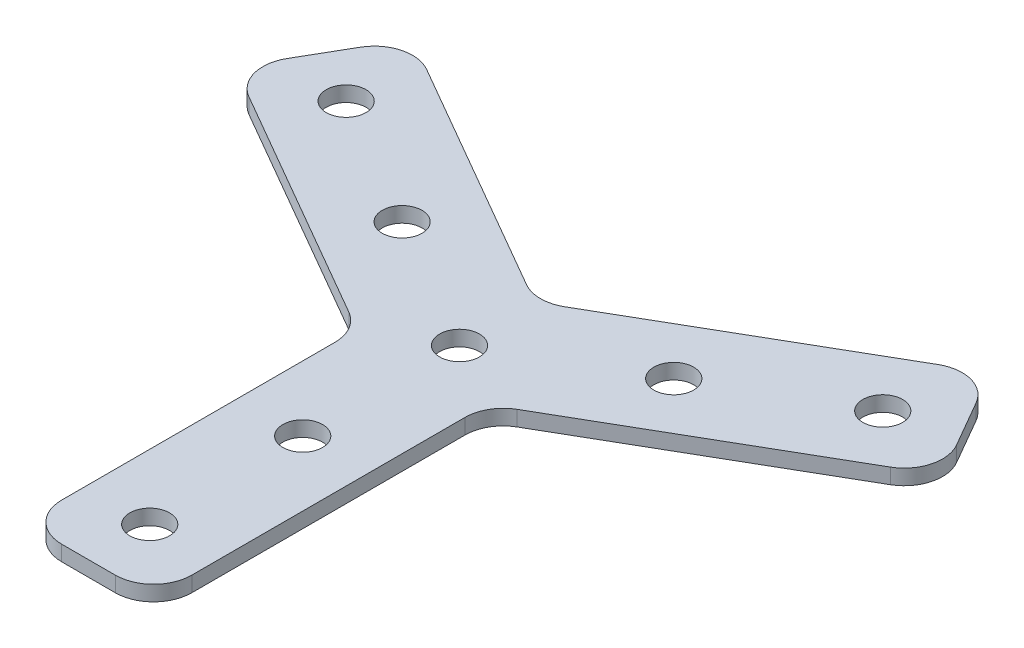
ISO-10303-21;
HEADER;
FILE_DESCRIPTION(('STEP AP214'),'2;1');
FILE_NAME('part.step','',(''),(''),'','','');
FILE_SCHEMA(('AUTOMOTIVE_DESIGN { 1 0 10303 214 1 1 1 1 }'));
ENDSEC;
DATA;
#1=APPLICATION_CONTEXT('core data for automotive mechanical design processes');
#2=APPLICATION_PROTOCOL_DEFINITION('international standard','automotive_design',2000,#1);
#3=PRODUCT_CONTEXT('',#1,'mechanical');
#4=PRODUCT('Part','Part','',(#3));
#5=PRODUCT_RELATED_PRODUCT_CATEGORY('part','',(#4));
#6=PRODUCT_DEFINITION_FORMATION('','',#4);
#7=PRODUCT_DEFINITION_CONTEXT('part definition',#1,'design');
#8=PRODUCT_DEFINITION('design','',#6,#7);
#9=PRODUCT_DEFINITION_SHAPE('','',#8);
#10=(LENGTH_UNIT() NAMED_UNIT(*) SI_UNIT(.MILLI.,.METRE.));
#11=(NAMED_UNIT(*) PLANE_ANGLE_UNIT() SI_UNIT($,.RADIAN.));
#12=(NAMED_UNIT(*) SI_UNIT($,.STERADIAN.) SOLID_ANGLE_UNIT());
#13=UNCERTAINTY_MEASURE_WITH_UNIT(LENGTH_MEASURE(1.E-05),#10,'distance_accuracy_value','');
#14=(GEOMETRIC_REPRESENTATION_CONTEXT(3) GLOBAL_UNCERTAINTY_ASSIGNED_CONTEXT((#13)) GLOBAL_UNIT_ASSIGNED_CONTEXT((#10,
#11,#12)) REPRESENTATION_CONTEXT('',''));
#15=CARTESIAN_POINT('',(0.,0.,0.));
#16=DIRECTION('',(0.,0.,1.));
#17=DIRECTION('',(1.,0.,0.));
#18=AXIS2_PLACEMENT_3D('',#15,#16,#17);
#19=CARTESIAN_POINT('',(-0.941002354523629,3.05807034319605,-10.4761890653163));
#20=DIRECTION('',(0.,-1.,0.));
#21=DIRECTION('',(0.,0.,-1.));
#22=AXIS2_PLACEMENT_3D('',#19,#20,#21);
#23=PLANE('',#22);
#24=CARTESIAN_POINT('',(16.8125184230581,3.05807034319605,-20.726189065315));
#25=DIRECTION('',(0.,1.,0.));
#26=DIRECTION('',(0.,0.,1.));
#27=AXIS2_PLACEMENT_3D('',#24,#25,#26);
#28=CIRCLE('',#27,2.6);
#29=CARTESIAN_POINT('',(16.8125184230581,3.05807034319605,-18.126189065315));
#30=VERTEX_POINT('',#29);
#31=EDGE_CURVE('E173',#30,#30,#28,.T.);
#32=ORIENTED_EDGE('',*,*,#31,.F.);
#33=EDGE_LOOP('',(#32));
#34=FACE_BOUND('',#33,.T.);
#35=CARTESIAN_POINT('',(34.1330264987469,3.05807034319605,-30.726189065315));
#36=DIRECTION('',(0.,1.,0.));
#37=DIRECTION('',(0.,0.,1.));
#38=AXIS2_PLACEMENT_3D('',#35,#36,#37);
#39=CIRCLE('',#38,2.6);
#40=CARTESIAN_POINT('',(34.1330264987469,3.05807034319605,-28.126189065315));
#41=VERTEX_POINT('',#40);
#42=EDGE_CURVE('E323',#41,#41,#39,.T.);
#43=ORIENTED_EDGE('',*,*,#42,.F.);
#44=EDGE_LOOP('',(#43));
#45=FACE_BOUND('',#44,.T.);
#46=CARTESIAN_POINT('',(-0.941002354525161,3.05807034319605,10.0238109346837));
#47=DIRECTION('',(0.,1.,0.));
#48=DIRECTION('',(-0.866025403784436,0.,-0.500000000000004));
#49=AXIS2_PLACEMENT_3D('',#46,#47,#48);
#50=CIRCLE('',#49,2.6);
#51=CARTESIAN_POINT('',(-3.19266840436469,3.05807034319605,8.72381093468372));
#52=VERTEX_POINT('',#51);
#53=EDGE_CURVE('E317',#52,#52,#50,.T.);
#54=ORIENTED_EDGE('',*,*,#53,.F.);
#55=EDGE_LOOP('',(#54));
#56=FACE_BOUND('',#55,.T.);
#57=CARTESIAN_POINT('',(-0.941002354525256,3.05807034319605,30.0238109346837));
#58=DIRECTION('',(0.,1.,0.));
#59=DIRECTION('',(-0.866025403784436,0.,-0.500000000000004));
#60=AXIS2_PLACEMENT_3D('',#57,#58,#59);
#61=CIRCLE('',#60,2.6);
#62=CARTESIAN_POINT('',(-3.19266840436479,3.05807034319605,28.7238109346837));
#63=VERTEX_POINT('',#62);
#64=EDGE_CURVE('E311',#63,#63,#61,.T.);
#65=ORIENTED_EDGE('',*,*,#64,.F.);
#66=EDGE_LOOP('',(#65));
#67=FACE_BOUND('',#66,.T.);
#68=CARTESIAN_POINT('',(-18.6945231321038,3.05807034319605,-20.7261890653177));
#69=DIRECTION('',(0.,1.,0.));
#70=DIRECTION('',(0.866025403784443,0.,-0.499999999999992));
#71=AXIS2_PLACEMENT_3D('',#68,#69,#70);
#72=CIRCLE('',#71,2.6);
#73=CARTESIAN_POINT('',(-16.4428570822643,3.05807034319605,-22.0261890653177));
#74=VERTEX_POINT('',#73);
#75=EDGE_CURVE('E305',#74,#74,#72,.T.);
#76=ORIENTED_EDGE('',*,*,#75,.F.);
#77=EDGE_LOOP('',(#76));
#78=FACE_BOUND('',#77,.T.);
#79=CARTESIAN_POINT('',(-36.0150312077925,3.05807034319605,-30.7261890653179));
#80=DIRECTION('',(0.,1.,0.));
#81=DIRECTION('',(0.866025403784443,0.,-0.499999999999992));
#82=AXIS2_PLACEMENT_3D('',#79,#80,#81);
#83=CIRCLE('',#82,2.6);
#84=CARTESIAN_POINT('',(-33.7633651579529,3.05807034319605,-32.0261890653178));
#85=VERTEX_POINT('',#84);
#86=EDGE_CURVE('E299',#85,#85,#83,.T.);
#87=ORIENTED_EDGE('',*,*,#86,.F.);
#88=EDGE_LOOP('',(#87));
#89=FACE_BOUND('',#88,.T.);
#90=CARTESIAN_POINT('',(-0.941002354523629,3.05807034319605,-10.4761890653163));
#91=DIRECTION('',(0.,1.,0.));
#92=DIRECTION('',(0.,0.,1.));
#93=AXIS2_PLACEMENT_3D('',#90,#91,#92);
#94=CIRCLE('',#93,2.6);
#95=CARTESIAN_POINT('',(-0.941002354523629,3.05807034319605,-7.87618906531628));
#96=VERTEX_POINT('',#95);
#97=EDGE_CURVE('E279',#96,#96,#94,.T.);
#98=ORIENTED_EDGE('',*,*,#97,.F.);
#99=EDGE_LOOP('',(#98));
#100=FACE_BOUND('',#99,.T.);
#101=DIRECTION('',(0.866025403784439,0.,-0.5));
#102=VECTOR('',#101,1.);
#103=CARTESIAN_POINT('',(7.5589976454764,3.05807034319605,-5.56871177720254));
#104=LINE('',#103,#102);
#105=CARTESIAN_POINT('',(10.0589976454763,3.05807034319605,-7.01208745017655));
#106=VERTEX_POINT('',#105);
#107=CARTESIAN_POINT('',(40.9811027101003,3.05807034319605,-24.8649731331471));
#108=VERTEX_POINT('',#107);
#109=EDGE_CURVE('E280',#106,#108,#104,.T.);
#110=ORIENTED_EDGE('',*,*,#109,.T.);
#111=CARTESIAN_POINT('',(38.4811027101003,3.05807034319605,-29.1951001520693));
#112=DIRECTION('',(0.,-1.,0.));
#113=DIRECTION('',(0.,0.,-1.));
#114=AXIS2_PLACEMENT_3D('',#111,#112,#113);
#115=CIRCLE('',#114,5.);
#116=CARTESIAN_POINT('',(42.8112297290225,3.05807034319605,-31.6951001520693));
#117=VERTEX_POINT('',#116);
#118=EDGE_CURVE('E187',#108,#117,#115,.F.);
#119=ORIENTED_EDGE('',*,*,#118,.T.);
#120=DIRECTION('',(-0.5,0.,-0.866025403784439));
#121=VECTOR('',#120,1.);
#122=CARTESIAN_POINT('',(45.3112297290225,3.05807034319605,-27.3649731331471));
#123=LINE('',#122,#121);
#124=CARTESIAN_POINT('',(39.3112297290222,3.05807034319605,-37.7572779785608));
#125=VERTEX_POINT('',#124);
#126=EDGE_CURVE('E282',#117,#125,#123,.T.);
#127=ORIENTED_EDGE('',*,*,#126,.T.);
#128=CARTESIAN_POINT('',(34.9811027101,3.05807034319605,-35.2572779785608));
#129=DIRECTION('',(0.,-1.,0.));
#130=DIRECTION('',(0.,0.,-1.));
#131=AXIS2_PLACEMENT_3D('',#128,#129,#130);
#132=CIRCLE('',#131,5.);
#133=CARTESIAN_POINT('',(32.4811027101,3.05807034319605,-39.587404997483));
#134=VERTEX_POINT('',#133);
#135=EDGE_CURVE('E185',#125,#134,#132,.F.);
#136=ORIENTED_EDGE('',*,*,#135,.T.);
#137=DIRECTION('',(-0.866025403784439,0.,0.5));
#138=VECTOR('',#137,1.);
#139=CARTESIAN_POINT('',(36.8112297290222,3.05807034319605,-42.087404997483));
#140=LINE('',#139,#138);
#141=CARTESIAN_POINT('',(1.5589976454767,3.05807034319605,-21.7345193145128));
#142=VERTEX_POINT('',#141);
#143=EDGE_CURVE('E285',#134,#142,#140,.T.);
#144=ORIENTED_EDGE('',*,*,#143,.T.);
#145=CARTESIAN_POINT('',(-0.94100235452331,3.05807034319605,-26.064646333435));
#146=DIRECTION('',(0.,-1.,0.));
#147=DIRECTION('',(0.,0.,-1.));
#148=AXIS2_PLACEMENT_3D('',#145,#146,#147);
#149=CIRCLE('',#148,5.);
#150=CARTESIAN_POINT('',(-3.44100235452361,3.05807034319605,-21.734519314513));
#151=VERTEX_POINT('',#150);
#152=EDGE_CURVE('E237',#142,#151,#149,.T.);
#153=ORIENTED_EDGE('',*,*,#152,.T.);
#154=DIRECTION('',(-0.866025403784404,0.,-0.500000000000061));
#155=VECTOR('',#154,1.);
#156=CARTESIAN_POINT('',(-0.941002354523508,3.05807034319605,-20.2911436415386));
#157=LINE('',#156,#155);
#158=CARTESIAN_POINT('',(-34.3631074191455,3.05807034319605,-39.5874049974853));
#159=VERTEX_POINT('',#158);
#160=EDGE_CURVE('E288',#151,#159,#157,.T.);
#161=ORIENTED_EDGE('',*,*,#160,.T.);
#162=CARTESIAN_POINT('',(-36.8631074191458,3.05807034319605,-35.2572779785632));
#163=DIRECTION('',(0.,-1.,0.));
#164=DIRECTION('',(0.,0.,-1.));
#165=AXIS2_PLACEMENT_3D('',#162,#163,#164);
#166=CIRCLE('',#165,5.);
#167=CARTESIAN_POINT('',(-41.193234438068,3.05807034319605,-37.7572779785633));
#168=VERTEX_POINT('',#167);
#169=EDGE_CURVE('E183',#159,#168,#166,.F.);
#170=ORIENTED_EDGE('',*,*,#169,.T.);
#171=DIRECTION('',(-0.500000000000008,0.,0.866025403784434));
#172=VECTOR('',#171,1.);
#173=CARTESIAN_POINT('',(-38.6932344380678,3.05807034319605,-42.0874049974857));
#174=LINE('',#173,#172);
#175=CARTESIAN_POINT('',(-44.6932344380682,3.05807034319605,-31.695100152072));
#176=VERTEX_POINT('',#175);
#177=EDGE_CURVE('E291',#168,#176,#174,.T.);
#178=ORIENTED_EDGE('',*,*,#177,.T.);
#179=CARTESIAN_POINT('',(-40.363107419146,3.05807034319605,-29.195100152072));
#180=DIRECTION('',(0.,-1.,0.));
#181=DIRECTION('',(0.,0.,-1.));
#182=AXIS2_PLACEMENT_3D('',#179,#180,#181);
#183=CIRCLE('',#182,5.);
#184=CARTESIAN_POINT('',(-42.8631074191462,3.05807034319605,-24.8649731331499));
#185=VERTEX_POINT('',#184);
#186=EDGE_CURVE('E153',#176,#185,#183,.F.);
#187=ORIENTED_EDGE('',*,*,#186,.T.);
#188=DIRECTION('',(0.866025403784421,0.,0.500000000000031));
#189=VECTOR('',#188,1.);
#190=CARTESIAN_POINT('',(-47.1932344380682,3.05807034319605,-27.3649731331499));
#191=LINE('',#190,#189);
#192=CARTESIAN_POINT('',(-11.9410023545252,3.05807034319605,-7.01208745017954));
#193=VERTEX_POINT('',#192);
#194=EDGE_CURVE('E244',#185,#193,#191,.T.);
#195=ORIENTED_EDGE('',*,*,#194,.T.);
#196=CARTESIAN_POINT('',(-14.4410023545253,3.05807034319605,-2.68196043125743));
#197=DIRECTION('',(0.,-1.,0.));
#198=DIRECTION('',(0.,0.,-1.));
#199=AXIS2_PLACEMENT_3D('',#196,#197,#198);
#200=CIRCLE('',#199,5.);
#201=CARTESIAN_POINT('',(-9.44100235452534,3.05807034319605,-2.68196043125741));
#202=VERTEX_POINT('',#201);
#203=EDGE_CURVE('E24',#193,#202,#200,.T.);
#204=ORIENTED_EDGE('',*,*,#203,.T.);
#205=DIRECTION('',(0.,0.,1.));
#206=VECTOR('',#205,1.);
#207=CARTESIAN_POINT('',(-9.44100235452533,3.05807034319605,-5.56871177720543));
#208=LINE('',#207,#206);
#209=CARTESIAN_POINT('',(-9.4410023545255,3.05807034319605,33.0238109346837));
#210=VERTEX_POINT('',#209);
#211=EDGE_CURVE('E242',#202,#210,#208,.T.);
#212=ORIENTED_EDGE('',*,*,#211,.T.);
#213=CARTESIAN_POINT('',(-4.4410023545255,3.05807034319605,33.0238109346837));
#214=DIRECTION('',(0.,-1.,0.));
#215=DIRECTION('',(0.,0.,-1.));
#216=AXIS2_PLACEMENT_3D('',#213,#214,#215);
#217=CIRCLE('',#216,5.);
#218=CARTESIAN_POINT('',(-4.44100235452552,3.05807034319605,38.0238109346837));
#219=VERTEX_POINT('',#218);
#220=EDGE_CURVE('E152',#210,#219,#217,.F.);
#221=ORIENTED_EDGE('',*,*,#220,.T.);
#222=DIRECTION('',(1.,0.,0.));
#223=VECTOR('',#222,1.);
#224=CARTESIAN_POINT('',(-9.44100235452552,3.05807034319605,38.0238109346837));
#225=LINE('',#224,#223);
#226=CARTESIAN_POINT('',(2.55899764547517,3.05807034319605,38.0238109346838));
#227=VERTEX_POINT('',#226);
#228=EDGE_CURVE('E147',#219,#227,#225,.T.);
#229=ORIENTED_EDGE('',*,*,#228,.T.);
#230=CARTESIAN_POINT('',(2.55899764547519,3.05807034319605,33.0238109346838));
#231=DIRECTION('',(0.,-1.,0.));
#232=DIRECTION('',(0.,0.,-1.));
#233=AXIS2_PLACEMENT_3D('',#230,#231,#232);
#234=CIRCLE('',#233,5.);
#235=CARTESIAN_POINT('',(7.55899764547519,3.05807034319605,33.0238109346839));
#236=VERTEX_POINT('',#235);
#237=EDGE_CURVE('E142',#227,#236,#234,.F.);
#238=ORIENTED_EDGE('',*,*,#237,.T.);
#239=DIRECTION('',(0.,0.,-1.));
#240=VECTOR('',#239,1.);
#241=CARTESIAN_POINT('',(7.55899764547504,3.05807034319605,38.0238109346838));
#242=LINE('',#241,#240);
#243=CARTESIAN_POINT('',(7.55899764547631,3.05807034319605,-2.68196043125452));
#244=VERTEX_POINT('',#243);
#245=EDGE_CURVE('E145',#236,#244,#242,.T.);
#246=ORIENTED_EDGE('',*,*,#245,.T.);
#247=CARTESIAN_POINT('',(12.5589976454763,3.05807034319605,-2.68196043125436));
#248=DIRECTION('',(0.,-1.,0.));
#249=DIRECTION('',(0.,0.,-1.));
#250=AXIS2_PLACEMENT_3D('',#247,#248,#249);
#251=CIRCLE('',#250,5.);
#252=EDGE_CURVE('E233',#244,#106,#251,.T.);
#253=ORIENTED_EDGE('',*,*,#252,.T.);
#254=EDGE_LOOP('',(#110,#119,#127,#136,#144,#153,#161,#170,#178,#187,#195,#204,#212,#221,#229,
#238,#246,#253));
#255=FACE_BOUND('',#254,.T.);
#256=ADVANCED_FACE('F16',(#34,#45,#56,#67,#78,#89,#100,#255),#23,.F.);
#257=CARTESIAN_POINT('',(-0.941002354523629,1.05807034319605,-10.4761890653163));
#258=DIRECTION('',(0.,-1.,0.));
#259=DIRECTION('',(0.,0.,-1.));
#260=AXIS2_PLACEMENT_3D('',#257,#258,#259);
#261=PLANE('',#260);
#262=CARTESIAN_POINT('',(16.8125184230581,1.05807034319605,-20.726189065315));
#263=DIRECTION('',(0.,1.,0.));
#264=DIRECTION('',(0.,0.,1.));
#265=AXIS2_PLACEMENT_3D('',#262,#263,#264);
#266=CIRCLE('',#265,2.6);
#267=CARTESIAN_POINT('',(16.8125184230581,1.05807034319605,-18.126189065315));
#268=VERTEX_POINT('',#267);
#269=EDGE_CURVE('E168',#268,#268,#266,.T.);
#270=ORIENTED_EDGE('',*,*,#269,.T.);
#271=EDGE_LOOP('',(#270));
#272=FACE_BOUND('',#271,.T.);
#273=CARTESIAN_POINT('',(34.1330264987469,1.05807034319605,-30.726189065315));
#274=DIRECTION('',(0.,1.,0.));
#275=DIRECTION('',(0.,0.,1.));
#276=AXIS2_PLACEMENT_3D('',#273,#274,#275);
#277=CIRCLE('',#276,2.6);
#278=CARTESIAN_POINT('',(34.1330264987469,1.05807034319605,-28.126189065315));
#279=VERTEX_POINT('',#278);
#280=EDGE_CURVE('E326',#279,#279,#277,.T.);
#281=ORIENTED_EDGE('',*,*,#280,.T.);
#282=EDGE_LOOP('',(#281));
#283=FACE_BOUND('',#282,.T.);
#284=CARTESIAN_POINT('',(-0.941002354525161,1.05807034319605,10.0238109346837));
#285=DIRECTION('',(0.,1.,0.));
#286=DIRECTION('',(-0.866025403784436,0.,-0.500000000000004));
#287=AXIS2_PLACEMENT_3D('',#284,#285,#286);
#288=CIRCLE('',#287,2.6);
#289=CARTESIAN_POINT('',(-3.19266840436469,1.05807034319605,8.72381093468372));
#290=VERTEX_POINT('',#289);
#291=EDGE_CURVE('E320',#290,#290,#288,.T.);
#292=ORIENTED_EDGE('',*,*,#291,.T.);
#293=EDGE_LOOP('',(#292));
#294=FACE_BOUND('',#293,.T.);
#295=CARTESIAN_POINT('',(-0.941002354525256,1.05807034319605,30.0238109346837));
#296=DIRECTION('',(0.,1.,0.));
#297=DIRECTION('',(-0.866025403784436,0.,-0.500000000000004));
#298=AXIS2_PLACEMENT_3D('',#295,#296,#297);
#299=CIRCLE('',#298,2.6);
#300=CARTESIAN_POINT('',(-3.19266840436479,1.05807034319605,28.7238109346837));
#301=VERTEX_POINT('',#300);
#302=EDGE_CURVE('E314',#301,#301,#299,.T.);
#303=ORIENTED_EDGE('',*,*,#302,.T.);
#304=EDGE_LOOP('',(#303));
#305=FACE_BOUND('',#304,.T.);
#306=CARTESIAN_POINT('',(-18.6945231321038,1.05807034319605,-20.7261890653177));
#307=DIRECTION('',(0.,1.,0.));
#308=DIRECTION('',(0.866025403784443,0.,-0.499999999999992));
#309=AXIS2_PLACEMENT_3D('',#306,#307,#308);
#310=CIRCLE('',#309,2.6);
#311=CARTESIAN_POINT('',(-16.4428570822643,1.05807034319605,-22.0261890653177));
#312=VERTEX_POINT('',#311);
#313=EDGE_CURVE('E308',#312,#312,#310,.T.);
#314=ORIENTED_EDGE('',*,*,#313,.T.);
#315=EDGE_LOOP('',(#314));
#316=FACE_BOUND('',#315,.T.);
#317=CARTESIAN_POINT('',(-36.0150312077925,1.05807034319605,-30.7261890653179));
#318=DIRECTION('',(0.,1.,0.));
#319=DIRECTION('',(0.866025403784443,0.,-0.499999999999992));
#320=AXIS2_PLACEMENT_3D('',#317,#318,#319);
#321=CIRCLE('',#320,2.6);
#322=CARTESIAN_POINT('',(-33.7633651579529,1.05807034319605,-32.0261890653178));
#323=VERTEX_POINT('',#322);
#324=EDGE_CURVE('E302',#323,#323,#321,.T.);
#325=ORIENTED_EDGE('',*,*,#324,.T.);
#326=EDGE_LOOP('',(#325));
#327=FACE_BOUND('',#326,.T.);
#328=CARTESIAN_POINT('',(-0.941002354523629,1.05807034319605,-10.4761890653163));
#329=DIRECTION('',(0.,1.,0.));
#330=DIRECTION('',(0.,0.,1.));
#331=AXIS2_PLACEMENT_3D('',#328,#329,#330);
#332=CIRCLE('',#331,2.6);
#333=CARTESIAN_POINT('',(-0.941002354523629,1.05807034319605,-7.87618906531628));
#334=VERTEX_POINT('',#333);
#335=EDGE_CURVE('E296',#334,#334,#332,.T.);
#336=ORIENTED_EDGE('',*,*,#335,.T.);
#337=EDGE_LOOP('',(#336));
#338=FACE_BOUND('',#337,.T.);
#339=DIRECTION('',(-0.5,0.,-0.866025403784439));
#340=VECTOR('',#339,1.);
#341=CARTESIAN_POINT('',(45.3112297290225,1.05807034319605,-27.3649731331471));
#342=LINE('',#341,#340);
#343=CARTESIAN_POINT('',(42.8112297290225,1.05807034319605,-31.6951001520693));
#344=VERTEX_POINT('',#343);
#345=CARTESIAN_POINT('',(39.3112297290222,1.05807034319605,-37.7572779785608));
#346=VERTEX_POINT('',#345);
#347=EDGE_CURVE('E435',#344,#346,#342,.T.);
#348=ORIENTED_EDGE('',*,*,#347,.F.);
#349=CARTESIAN_POINT('',(38.4811027101003,1.05807034319605,-29.1951001520693));
#350=DIRECTION('',(0.,-1.,0.));
#351=DIRECTION('',(0.,0.,-1.));
#352=AXIS2_PLACEMENT_3D('',#349,#350,#351);
#353=CIRCLE('',#352,5.);
#354=CARTESIAN_POINT('',(40.9811027101003,1.05807034319605,-24.8649731331471));
#355=VERTEX_POINT('',#354);
#356=EDGE_CURVE('E203',#344,#355,#353,.T.);
#357=ORIENTED_EDGE('',*,*,#356,.T.);
#358=DIRECTION('',(0.866025403784439,0.,-0.5));
#359=VECTOR('',#358,1.);
#360=CARTESIAN_POINT('',(7.5589976454764,1.05807034319605,-5.56871177720254));
#361=LINE('',#360,#359);
#362=CARTESIAN_POINT('',(10.0589976454763,1.05807034319605,-7.01208745017655));
#363=VERTEX_POINT('',#362);
#364=EDGE_CURVE('E163',#363,#355,#361,.T.);
#365=ORIENTED_EDGE('',*,*,#364,.F.);
#366=CARTESIAN_POINT('',(12.5589976454763,1.05807034319605,-2.68196043125436));
#367=DIRECTION('',(0.,-1.,0.));
#368=DIRECTION('',(0.,0.,-1.));
#369=AXIS2_PLACEMENT_3D('',#366,#367,#368);
#370=CIRCLE('',#369,5.);
#371=CARTESIAN_POINT('',(7.55899764547631,1.05807034319605,-2.68196043125452));
#372=VERTEX_POINT('',#371);
#373=EDGE_CURVE('E235',#363,#372,#370,.F.);
#374=ORIENTED_EDGE('',*,*,#373,.T.);
#375=DIRECTION('',(0.,0.,-1.));
#376=VECTOR('',#375,1.);
#377=CARTESIAN_POINT('',(7.55899764547504,1.05807034319605,38.0238109346838));
#378=LINE('',#377,#376);
#379=CARTESIAN_POINT('',(7.55899764547519,1.05807034319605,33.0238109346839));
#380=VERTEX_POINT('',#379);
#381=EDGE_CURVE('E277',#380,#372,#378,.T.);
#382=ORIENTED_EDGE('',*,*,#381,.F.);
#383=CARTESIAN_POINT('',(2.55899764547519,1.05807034319605,33.0238109346838));
#384=DIRECTION('',(0.,-1.,0.));
#385=DIRECTION('',(0.,0.,-1.));
#386=AXIS2_PLACEMENT_3D('',#383,#384,#385);
#387=CIRCLE('',#386,5.);
#388=CARTESIAN_POINT('',(2.55899764547517,1.05807034319605,38.0238109346838));
#389=VERTEX_POINT('',#388);
#390=EDGE_CURVE('E167',#380,#389,#387,.T.);
#391=ORIENTED_EDGE('',*,*,#390,.T.);
#392=DIRECTION('',(1.,0.,0.));
#393=VECTOR('',#392,1.);
#394=CARTESIAN_POINT('',(-9.44100235452552,1.05807034319605,38.0238109346837));
#395=LINE('',#394,#393);
#396=CARTESIAN_POINT('',(-4.44100235452552,1.05807034319605,38.0238109346837));
#397=VERTEX_POINT('',#396);
#398=EDGE_CURVE('E268',#397,#389,#395,.T.);
#399=ORIENTED_EDGE('',*,*,#398,.F.);
#400=CARTESIAN_POINT('',(-4.4410023545255,1.05807034319605,33.0238109346837));
#401=DIRECTION('',(0.,-1.,0.));
#402=DIRECTION('',(0.,0.,-1.));
#403=AXIS2_PLACEMENT_3D('',#400,#401,#402);
#404=CIRCLE('',#403,5.);
#405=CARTESIAN_POINT('',(-9.4410023545255,1.05807034319605,33.0238109346837));
#406=VERTEX_POINT('',#405);
#407=EDGE_CURVE('E197',#397,#406,#404,.T.);
#408=ORIENTED_EDGE('',*,*,#407,.T.);
#409=DIRECTION('',(0.,0.,1.));
#410=VECTOR('',#409,1.);
#411=CARTESIAN_POINT('',(-9.44100235452533,1.05807034319605,-5.56871177720543));
#412=LINE('',#411,#410);
#413=CARTESIAN_POINT('',(-9.44100235452534,1.05807034319605,-2.68196043125741));
#414=VERTEX_POINT('',#413);
#415=EDGE_CURVE('E262',#414,#406,#412,.T.);
#416=ORIENTED_EDGE('',*,*,#415,.F.);
#417=CARTESIAN_POINT('',(-14.4410023545253,1.05807034319605,-2.68196043125743));
#418=DIRECTION('',(0.,-1.,0.));
#419=DIRECTION('',(0.,0.,-1.));
#420=AXIS2_PLACEMENT_3D('',#417,#418,#419);
#421=CIRCLE('',#420,5.);
#422=CARTESIAN_POINT('',(-11.9410023545252,1.05807034319605,-7.01208745017954));
#423=VERTEX_POINT('',#422);
#424=EDGE_CURVE('E10',#414,#423,#421,.F.);
#425=ORIENTED_EDGE('',*,*,#424,.T.);
#426=DIRECTION('',(0.866025403784421,0.,0.500000000000031));
#427=VECTOR('',#426,1.);
#428=CARTESIAN_POINT('',(-47.1932344380682,1.05807034319605,-27.3649731331499));
#429=LINE('',#428,#427);
#430=CARTESIAN_POINT('',(-42.8631074191462,1.05807034319605,-24.8649731331499));
#431=VERTEX_POINT('',#430);
#432=EDGE_CURVE('E260',#431,#423,#429,.T.);
#433=ORIENTED_EDGE('',*,*,#432,.F.);
#434=CARTESIAN_POINT('',(-40.363107419146,1.05807034319605,-29.195100152072));
#435=DIRECTION('',(0.,-1.,0.));
#436=DIRECTION('',(0.,0.,-1.));
#437=AXIS2_PLACEMENT_3D('',#434,#435,#436);
#438=CIRCLE('',#437,5.);
#439=CARTESIAN_POINT('',(-44.6932344380682,1.05807034319605,-31.695100152072));
#440=VERTEX_POINT('',#439);
#441=EDGE_CURVE('E194',#431,#440,#438,.T.);
#442=ORIENTED_EDGE('',*,*,#441,.T.);
#443=DIRECTION('',(-0.500000000000008,0.,0.866025403784434));
#444=VECTOR('',#443,1.);
#445=CARTESIAN_POINT('',(-38.6932344380678,1.05807034319605,-42.0874049974857));
#446=LINE('',#445,#444);
#447=CARTESIAN_POINT('',(-41.193234438068,1.05807034319605,-37.7572779785633));
#448=VERTEX_POINT('',#447);
#449=EDGE_CURVE('E266',#448,#440,#446,.T.);
#450=ORIENTED_EDGE('',*,*,#449,.F.);
#451=CARTESIAN_POINT('',(-36.8631074191458,1.05807034319605,-35.2572779785632));
#452=DIRECTION('',(0.,-1.,0.));
#453=DIRECTION('',(0.,0.,-1.));
#454=AXIS2_PLACEMENT_3D('',#451,#452,#453);
#455=CIRCLE('',#454,5.);
#456=CARTESIAN_POINT('',(-34.3631074191455,1.05807034319605,-39.5874049974853));
#457=VERTEX_POINT('',#456);
#458=EDGE_CURVE('E199',#448,#457,#455,.T.);
#459=ORIENTED_EDGE('',*,*,#458,.T.);
#460=DIRECTION('',(-0.866025403784404,0.,-0.500000000000061));
#461=VECTOR('',#460,1.);
#462=CARTESIAN_POINT('',(-0.941002354523508,1.05807034319605,-20.2911436415386));
#463=LINE('',#462,#461);
#464=CARTESIAN_POINT('',(-3.44100235452361,1.05807034319605,-21.734519314513));
#465=VERTEX_POINT('',#464);
#466=EDGE_CURVE('E271',#465,#457,#463,.T.);
#467=ORIENTED_EDGE('',*,*,#466,.F.);
#468=CARTESIAN_POINT('',(-0.94100235452331,1.05807034319605,-26.064646333435));
#469=DIRECTION('',(0.,-1.,0.));
#470=DIRECTION('',(0.,0.,-1.));
#471=AXIS2_PLACEMENT_3D('',#468,#469,#470);
#472=CIRCLE('',#471,5.);
#473=CARTESIAN_POINT('',(1.5589976454767,1.05807034319605,-21.7345193145128));
#474=VERTEX_POINT('',#473);
#475=EDGE_CURVE('E31',#465,#474,#472,.F.);
#476=ORIENTED_EDGE('',*,*,#475,.T.);
#477=DIRECTION('',(-0.866025403784439,0.,0.5));
#478=VECTOR('',#477,1.);
#479=CARTESIAN_POINT('',(36.8112297290222,1.05807034319605,-42.087404997483));
#480=LINE('',#479,#478);
#481=CARTESIAN_POINT('',(32.4811027101,1.05807034319605,-39.587404997483));
#482=VERTEX_POINT('',#481);
#483=EDGE_CURVE('E434',#482,#474,#480,.T.);
#484=ORIENTED_EDGE('',*,*,#483,.F.);
#485=CARTESIAN_POINT('',(34.9811027101,1.05807034319605,-35.2572779785608));
#486=DIRECTION('',(0.,-1.,0.));
#487=DIRECTION('',(0.,0.,-1.));
#488=AXIS2_PLACEMENT_3D('',#485,#486,#487);
#489=CIRCLE('',#488,5.);
#490=EDGE_CURVE('E201',#482,#346,#489,.T.);
#491=ORIENTED_EDGE('',*,*,#490,.T.);
#492=EDGE_LOOP('',(#348,#357,#365,#374,#382,#391,#399,#408,#416,#425,#433,#442,#450,#459,#467,
#476,#484,#491));
#493=FACE_BOUND('',#492,.T.);
#494=ADVANCED_FACE('F259',(#272,#283,#294,#305,#316,#327,#338,#493),#261,.T.);
#495=CARTESIAN_POINT('',(16.8125184230581,1.05807034319605,-20.726189065315));
#496=DIRECTION('',(0.,1.,0.));
#497=DIRECTION('',(0.,0.,1.));
#498=AXIS2_PLACEMENT_3D('',#495,#496,#497);
#499=CYLINDRICAL_SURFACE('',#498,2.6);
#500=ORIENTED_EDGE('',*,*,#269,.F.);
#501=EDGE_LOOP('',(#500));
#502=FACE_BOUND('',#501,.T.);
#503=ORIENTED_EDGE('',*,*,#31,.T.);
#504=EDGE_LOOP('',(#503));
#505=FACE_BOUND('',#504,.T.);
#506=ADVANCED_FACE('F380',(#502,#505),#499,.F.);
#507=CARTESIAN_POINT('',(34.1330264987469,1.05807034319605,-30.726189065315));
#508=DIRECTION('',(0.,1.,0.));
#509=DIRECTION('',(0.,0.,1.));
#510=AXIS2_PLACEMENT_3D('',#507,#508,#509);
#511=CYLINDRICAL_SURFACE('',#510,2.6);
#512=ORIENTED_EDGE('',*,*,#280,.F.);
#513=EDGE_LOOP('',(#512));
#514=FACE_BOUND('',#513,.T.);
#515=ORIENTED_EDGE('',*,*,#42,.T.);
#516=EDGE_LOOP('',(#515));
#517=FACE_BOUND('',#516,.T.);
#518=ADVANCED_FACE('F332',(#514,#517),#511,.F.);
#519=CARTESIAN_POINT('',(-0.941002354525161,1.05807034319605,10.0238109346837));
#520=DIRECTION('',(0.,1.,0.));
#521=DIRECTION('',(0.,0.,1.));
#522=AXIS2_PLACEMENT_3D('',#519,#520,#521);
#523=CYLINDRICAL_SURFACE('',#522,2.6);
#524=ORIENTED_EDGE('',*,*,#291,.F.);
#525=EDGE_LOOP('',(#524));
#526=FACE_BOUND('',#525,.T.);
#527=ORIENTED_EDGE('',*,*,#53,.T.);
#528=EDGE_LOOP('',(#527));
#529=FACE_BOUND('',#528,.T.);
#530=ADVANCED_FACE('F373',(#526,#529),#523,.F.);
#531=CARTESIAN_POINT('',(-0.941002354525256,1.05807034319605,30.0238109346837));
#532=DIRECTION('',(0.,1.,0.));
#533=DIRECTION('',(0.,0.,1.));
#534=AXIS2_PLACEMENT_3D('',#531,#532,#533);
#535=CYLINDRICAL_SURFACE('',#534,2.6);
#536=ORIENTED_EDGE('',*,*,#302,.F.);
#537=EDGE_LOOP('',(#536));
#538=FACE_BOUND('',#537,.T.);
#539=ORIENTED_EDGE('',*,*,#64,.T.);
#540=EDGE_LOOP('',(#539));
#541=FACE_BOUND('',#540,.T.);
#542=ADVANCED_FACE('F369',(#538,#541),#535,.F.);
#543=CARTESIAN_POINT('',(-18.6945231321038,1.05807034319605,-20.7261890653177));
#544=DIRECTION('',(0.,1.,0.));
#545=DIRECTION('',(0.,0.,1.));
#546=AXIS2_PLACEMENT_3D('',#543,#544,#545);
#547=CYLINDRICAL_SURFACE('',#546,2.6);
#548=ORIENTED_EDGE('',*,*,#313,.F.);
#549=EDGE_LOOP('',(#548));
#550=FACE_BOUND('',#549,.T.);
#551=ORIENTED_EDGE('',*,*,#75,.T.);
#552=EDGE_LOOP('',(#551));
#553=FACE_BOUND('',#552,.T.);
#554=ADVANCED_FACE('F361',(#550,#553),#547,.F.);
#555=CARTESIAN_POINT('',(-36.0150312077925,1.05807034319605,-30.7261890653179));
#556=DIRECTION('',(0.,1.,0.));
#557=DIRECTION('',(0.,0.,1.));
#558=AXIS2_PLACEMENT_3D('',#555,#556,#557);
#559=CYLINDRICAL_SURFACE('',#558,2.6);
#560=ORIENTED_EDGE('',*,*,#324,.F.);
#561=EDGE_LOOP('',(#560));
#562=FACE_BOUND('',#561,.T.);
#563=ORIENTED_EDGE('',*,*,#86,.T.);
#564=EDGE_LOOP('',(#563));
#565=FACE_BOUND('',#564,.T.);
#566=ADVANCED_FACE('F351',(#562,#565),#559,.F.);
#567=CARTESIAN_POINT('',(-0.941002354523629,1.05807034319605,-10.4761890653163));
#568=DIRECTION('',(0.,1.,0.));
#569=DIRECTION('',(0.,0.,1.));
#570=AXIS2_PLACEMENT_3D('',#567,#568,#569);
#571=CYLINDRICAL_SURFACE('',#570,2.6);
#572=ORIENTED_EDGE('',*,*,#335,.F.);
#573=EDGE_LOOP('',(#572));
#574=FACE_BOUND('',#573,.T.);
#575=ORIENTED_EDGE('',*,*,#97,.T.);
#576=EDGE_LOOP('',(#575));
#577=FACE_BOUND('',#576,.T.);
#578=ADVANCED_FACE('F348',(#574,#577),#571,.F.);
#579=CARTESIAN_POINT('',(7.5589976454764,1.05807034319605,-5.56871177720254));
#580=DIRECTION('',(0.5,0.,0.866025403784439));
#581=DIRECTION('',(0.866025403784439,0.,-0.5));
#582=AXIS2_PLACEMENT_3D('',#579,#580,#581);
#583=PLANE('',#582);
#584=ORIENTED_EDGE('',*,*,#109,.F.);
#585=DIRECTION('',(0.,1.,0.));
#586=VECTOR('',#585,1.);
#587=CARTESIAN_POINT('',(10.0589976454763,1.05807034319605,-7.01208745017655));
#588=LINE('',#587,#586);
#589=EDGE_CURVE('E179',#106,#363,#588,.F.);
#590=ORIENTED_EDGE('',*,*,#589,.T.);
#591=ORIENTED_EDGE('',*,*,#364,.T.);
#592=DIRECTION('',(0.,1.,0.));
#593=VECTOR('',#592,1.);
#594=CARTESIAN_POINT('',(40.9811027101003,1.05807034319605,-24.8649731331471));
#595=LINE('',#594,#593);
#596=EDGE_CURVE('E170',#355,#108,#595,.T.);
#597=ORIENTED_EDGE('',*,*,#596,.T.);
#598=EDGE_LOOP('',(#584,#590,#591,#597));
#599=FACE_BOUND('',#598,.T.);
#600=ADVANCED_FACE('F350',(#599),#583,.T.);
#601=CARTESIAN_POINT('',(7.55899764547504,1.05807034319605,38.0238109346838));
#602=DIRECTION('',(1.,0.,0.));
#603=DIRECTION('',(0.,0.,-1.));
#604=AXIS2_PLACEMENT_3D('',#601,#602,#603);
#605=PLANE('',#604);
#606=ORIENTED_EDGE('',*,*,#381,.T.);
#607=DIRECTION('',(0.,1.,0.));
#608=VECTOR('',#607,1.);
#609=CARTESIAN_POINT('',(7.55899764547631,3.05807034319605,-2.68196043125452));
#610=LINE('',#609,#608);
#611=EDGE_CURVE('E162',#372,#244,#610,.T.);
#612=ORIENTED_EDGE('',*,*,#611,.T.);
#613=ORIENTED_EDGE('',*,*,#245,.F.);
#614=DIRECTION('',(0.,1.,0.));
#615=VECTOR('',#614,1.);
#616=CARTESIAN_POINT('',(7.55899764547519,1.05807034319605,33.0238109346839));
#617=LINE('',#616,#615);
#618=EDGE_CURVE('E159',#236,#380,#617,.F.);
#619=ORIENTED_EDGE('',*,*,#618,.T.);
#620=EDGE_LOOP('',(#606,#612,#613,#619));
#621=FACE_BOUND('',#620,.T.);
#622=ADVANCED_FACE('F158',(#621),#605,.T.);
#623=CARTESIAN_POINT('',(-9.44100235452552,1.05807034319605,38.0238109346837));
#624=DIRECTION('',(0.,0.,1.));
#625=DIRECTION('',(1.,0.,0.));
#626=AXIS2_PLACEMENT_3D('',#623,#624,#625);
#627=PLANE('',#626);
#628=ORIENTED_EDGE('',*,*,#228,.F.);
#629=DIRECTION('',(0.,1.,0.));
#630=VECTOR('',#629,1.);
#631=CARTESIAN_POINT('',(-4.44100235452552,1.05807034319605,38.0238109346837));
#632=LINE('',#631,#630);
#633=EDGE_CURVE('E231',#219,#397,#632,.F.);
#634=ORIENTED_EDGE('',*,*,#633,.T.);
#635=ORIENTED_EDGE('',*,*,#398,.T.);
#636=DIRECTION('',(0.,1.,0.));
#637=VECTOR('',#636,1.);
#638=CARTESIAN_POINT('',(2.55899764547517,1.05807034319605,38.0238109346838));
#639=LINE('',#638,#637);
#640=EDGE_CURVE('E229',#389,#227,#639,.T.);
#641=ORIENTED_EDGE('',*,*,#640,.T.);
#642=EDGE_LOOP('',(#628,#634,#635,#641));
#643=FACE_BOUND('',#642,.T.);
#644=ADVANCED_FACE('F468',(#643),#627,.T.);
#645=CARTESIAN_POINT('',(-9.44100235452533,1.05807034319605,-5.56871177720543));
#646=DIRECTION('',(-1.,0.,0.));
#647=DIRECTION('',(0.,0.,1.));
#648=AXIS2_PLACEMENT_3D('',#645,#646,#647);
#649=PLANE('',#648);
#650=ORIENTED_EDGE('',*,*,#211,.F.);
#651=DIRECTION('',(0.,1.,0.));
#652=VECTOR('',#651,1.);
#653=CARTESIAN_POINT('',(-9.44100235452534,1.05807034319605,-2.68196043125741));
#654=LINE('',#653,#652);
#655=EDGE_CURVE('E227',#202,#414,#654,.F.);
#656=ORIENTED_EDGE('',*,*,#655,.T.);
#657=ORIENTED_EDGE('',*,*,#415,.T.);
#658=DIRECTION('',(0.,1.,0.));
#659=VECTOR('',#658,1.);
#660=CARTESIAN_POINT('',(-9.4410023545255,1.05807034319605,33.0238109346837));
#661=LINE('',#660,#659);
#662=EDGE_CURVE('E224',#406,#210,#661,.T.);
#663=ORIENTED_EDGE('',*,*,#662,.T.);
#664=EDGE_LOOP('',(#650,#656,#657,#663));
#665=FACE_BOUND('',#664,.T.);
#666=ADVANCED_FACE('F249',(#665),#649,.T.);
#667=CARTESIAN_POINT('',(-47.1932344380682,1.05807034319605,-27.3649731331499));
#668=DIRECTION('',(-0.500000000000031,0.,0.866025403784421));
#669=DIRECTION('',(0.866025403784421,0.,0.500000000000031));
#670=AXIS2_PLACEMENT_3D('',#667,#668,#669);
#671=PLANE('',#670);
#672=ORIENTED_EDGE('',*,*,#432,.T.);
#673=DIRECTION('',(0.,1.,0.));
#674=VECTOR('',#673,1.);
#675=CARTESIAN_POINT('',(-11.9410023545252,3.05807034319605,-7.01208745017954));
#676=LINE('',#675,#674);
#677=EDGE_CURVE('E221',#423,#193,#676,.T.);
#678=ORIENTED_EDGE('',*,*,#677,.T.);
#679=ORIENTED_EDGE('',*,*,#194,.F.);
#680=DIRECTION('',(0.,1.,0.));
#681=VECTOR('',#680,1.);
#682=CARTESIAN_POINT('',(-42.8631074191462,1.05807034319605,-24.8649731331499));
#683=LINE('',#682,#681);
#684=EDGE_CURVE('E219',#185,#431,#683,.F.);
#685=ORIENTED_EDGE('',*,*,#684,.T.);
#686=EDGE_LOOP('',(#672,#678,#679,#685));
#687=FACE_BOUND('',#686,.T.);
#688=ADVANCED_FACE('F264',(#687),#671,.T.);
#689=CARTESIAN_POINT('',(-38.6932344380678,1.05807034319605,-42.0874049974857));
#690=DIRECTION('',(-0.866025403784434,0.,-0.500000000000008));
#691=DIRECTION('',(-0.500000000000008,0.,0.866025403784434));
#692=AXIS2_PLACEMENT_3D('',#689,#690,#691);
#693=PLANE('',#692);
#694=ORIENTED_EDGE('',*,*,#177,.F.);
#695=DIRECTION('',(0.,1.,0.));
#696=VECTOR('',#695,1.);
#697=CARTESIAN_POINT('',(-41.193234438068,1.05807034319605,-37.7572779785633));
#698=LINE('',#697,#696);
#699=EDGE_CURVE('E217',#168,#448,#698,.F.);
#700=ORIENTED_EDGE('',*,*,#699,.T.);
#701=ORIENTED_EDGE('',*,*,#449,.T.);
#702=DIRECTION('',(0.,1.,0.));
#703=VECTOR('',#702,1.);
#704=CARTESIAN_POINT('',(-44.6932344380682,1.05807034319605,-31.695100152072));
#705=LINE('',#704,#703);
#706=EDGE_CURVE('E214',#440,#176,#705,.T.);
#707=ORIENTED_EDGE('',*,*,#706,.T.);
#708=EDGE_LOOP('',(#694,#700,#701,#707));
#709=FACE_BOUND('',#708,.T.);
#710=ADVANCED_FACE('F426',(#709),#693,.T.);
#711=CARTESIAN_POINT('',(-0.941002354523508,1.05807034319605,-20.2911436415386));
#712=DIRECTION('',(0.500000000000061,0.,-0.866025403784404));
#713=DIRECTION('',(-0.866025403784404,0.,-0.500000000000061));
#714=AXIS2_PLACEMENT_3D('',#711,#712,#713);
#715=PLANE('',#714);
#716=ORIENTED_EDGE('',*,*,#160,.F.);
#717=DIRECTION('',(0.,1.,0.));
#718=VECTOR('',#717,1.);
#719=CARTESIAN_POINT('',(-3.44100235452361,1.05807034319605,-21.734519314513));
#720=LINE('',#719,#718);
#721=EDGE_CURVE('E212',#151,#465,#720,.F.);
#722=ORIENTED_EDGE('',*,*,#721,.T.);
#723=ORIENTED_EDGE('',*,*,#466,.T.);
#724=DIRECTION('',(0.,1.,0.));
#725=VECTOR('',#724,1.);
#726=CARTESIAN_POINT('',(-34.3631074191455,1.05807034319605,-39.5874049974853));
#727=LINE('',#726,#725);
#728=EDGE_CURVE('E209',#457,#159,#727,.T.);
#729=ORIENTED_EDGE('',*,*,#728,.T.);
#730=EDGE_LOOP('',(#716,#722,#723,#729));
#731=FACE_BOUND('',#730,.T.);
#732=ADVANCED_FACE('F432',(#731),#715,.T.);
#733=CARTESIAN_POINT('',(36.8112297290222,1.05807034319605,-42.087404997483));
#734=DIRECTION('',(-0.5,0.,-0.866025403784439));
#735=DIRECTION('',(-0.866025403784439,0.,0.5));
#736=AXIS2_PLACEMENT_3D('',#733,#734,#735);
#737=PLANE('',#736);
#738=ORIENTED_EDGE('',*,*,#143,.F.);
#739=DIRECTION('',(0.,1.,0.));
#740=VECTOR('',#739,1.);
#741=CARTESIAN_POINT('',(32.4811027101,1.05807034319605,-39.587404997483));
#742=LINE('',#741,#740);
#743=EDGE_CURVE('E38',#134,#482,#742,.F.);
#744=ORIENTED_EDGE('',*,*,#743,.T.);
#745=ORIENTED_EDGE('',*,*,#483,.T.);
#746=DIRECTION('',(0.,1.,0.));
#747=VECTOR('',#746,1.);
#748=CARTESIAN_POINT('',(1.55899764547669,3.05807034319605,-21.7345193145128));
#749=LINE('',#748,#747);
#750=EDGE_CURVE('E205',#474,#142,#749,.T.);
#751=ORIENTED_EDGE('',*,*,#750,.T.);
#752=EDGE_LOOP('',(#738,#744,#745,#751));
#753=FACE_BOUND('',#752,.T.);
#754=ADVANCED_FACE('F452',(#753),#737,.T.);
#755=CARTESIAN_POINT('',(45.3112297290225,1.05807034319605,-27.3649731331471));
#756=DIRECTION('',(0.866025403784439,0.,-0.5));
#757=DIRECTION('',(-0.5,0.,-0.866025403784439));
#758=AXIS2_PLACEMENT_3D('',#755,#756,#757);
#759=PLANE('',#758);
#760=ORIENTED_EDGE('',*,*,#126,.F.);
#761=DIRECTION('',(0.,1.,0.));
#762=VECTOR('',#761,1.);
#763=CARTESIAN_POINT('',(42.8112297290225,1.05807034319605,-31.6951001520693));
#764=LINE('',#763,#762);
#765=EDGE_CURVE('E192',#117,#344,#764,.F.);
#766=ORIENTED_EDGE('',*,*,#765,.T.);
#767=ORIENTED_EDGE('',*,*,#347,.T.);
#768=DIRECTION('',(0.,1.,0.));
#769=VECTOR('',#768,1.);
#770=CARTESIAN_POINT('',(39.3112297290222,1.05807034319605,-37.7572779785608));
#771=LINE('',#770,#769);
#772=EDGE_CURVE('E189',#346,#125,#771,.T.);
#773=ORIENTED_EDGE('',*,*,#772,.T.);
#774=EDGE_LOOP('',(#760,#766,#767,#773));
#775=FACE_BOUND('',#774,.T.);
#776=ADVANCED_FACE('F392',(#775),#759,.T.);
#777=CARTESIAN_POINT('',(12.5589976454763,1.05807034319605,-2.68196043125436));
#778=DIRECTION('',(0.,-1.,0.));
#779=DIRECTION('',(0.,0.,-1.));
#780=AXIS2_PLACEMENT_3D('',#777,#778,#779);
#781=CYLINDRICAL_SURFACE('',#780,5.);
#782=ORIENTED_EDGE('',*,*,#373,.F.);
#783=ORIENTED_EDGE('',*,*,#589,.F.);
#784=ORIENTED_EDGE('',*,*,#252,.F.);
#785=ORIENTED_EDGE('',*,*,#611,.F.);
#786=EDGE_LOOP('',(#782,#783,#784,#785));
#787=FACE_BOUND('',#786,.T.);
#788=ADVANCED_FACE('F388',(#787),#781,.F.);
#789=CARTESIAN_POINT('',(38.4811027101003,1.05807034319605,-29.1951001520693));
#790=DIRECTION('',(0.,1.,0.));
#791=DIRECTION('',(0.,0.,1.));
#792=AXIS2_PLACEMENT_3D('',#789,#790,#791);
#793=CYLINDRICAL_SURFACE('',#792,5.);
#794=ORIENTED_EDGE('',*,*,#356,.F.);
#795=ORIENTED_EDGE('',*,*,#765,.F.);
#796=ORIENTED_EDGE('',*,*,#118,.F.);
#797=ORIENTED_EDGE('',*,*,#596,.F.);
#798=EDGE_LOOP('',(#794,#795,#796,#797));
#799=FACE_BOUND('',#798,.T.);
#800=ADVANCED_FACE('F391',(#799),#793,.T.);
#801=CARTESIAN_POINT('',(34.9811027101,1.05807034319605,-35.2572779785608));
#802=DIRECTION('',(0.,1.,0.));
#803=DIRECTION('',(0.,0.,1.));
#804=AXIS2_PLACEMENT_3D('',#801,#802,#803);
#805=CYLINDRICAL_SURFACE('',#804,5.);
#806=ORIENTED_EDGE('',*,*,#490,.F.);
#807=ORIENTED_EDGE('',*,*,#743,.F.);
#808=ORIENTED_EDGE('',*,*,#135,.F.);
#809=ORIENTED_EDGE('',*,*,#772,.F.);
#810=EDGE_LOOP('',(#806,#807,#808,#809));
#811=FACE_BOUND('',#810,.T.);
#812=ADVANCED_FACE('F396',(#811),#805,.T.);
#813=CARTESIAN_POINT('',(-0.94100235452331,1.05807034319605,-26.064646333435));
#814=DIRECTION('',(0.,-1.,0.));
#815=DIRECTION('',(0.,0.,-1.));
#816=AXIS2_PLACEMENT_3D('',#813,#814,#815);
#817=CYLINDRICAL_SURFACE('',#816,5.);
#818=ORIENTED_EDGE('',*,*,#475,.F.);
#819=ORIENTED_EDGE('',*,*,#721,.F.);
#820=ORIENTED_EDGE('',*,*,#152,.F.);
#821=ORIENTED_EDGE('',*,*,#750,.F.);
#822=EDGE_LOOP('',(#818,#819,#820,#821));
#823=FACE_BOUND('',#822,.T.);
#824=ADVANCED_FACE('F400',(#823),#817,.F.);
#825=CARTESIAN_POINT('',(-36.8631074191458,1.05807034319605,-35.2572779785632));
#826=DIRECTION('',(0.,1.,0.));
#827=DIRECTION('',(0.,0.,1.));
#828=AXIS2_PLACEMENT_3D('',#825,#826,#827);
#829=CYLINDRICAL_SURFACE('',#828,5.);
#830=ORIENTED_EDGE('',*,*,#458,.F.);
#831=ORIENTED_EDGE('',*,*,#699,.F.);
#832=ORIENTED_EDGE('',*,*,#169,.F.);
#833=ORIENTED_EDGE('',*,*,#728,.F.);
#834=EDGE_LOOP('',(#830,#831,#832,#833));
#835=FACE_BOUND('',#834,.T.);
#836=ADVANCED_FACE('F404',(#835),#829,.T.);
#837=CARTESIAN_POINT('',(-14.4410023545253,1.05807034319605,-2.68196043125743));
#838=DIRECTION('',(0.,-1.,0.));
#839=DIRECTION('',(0.,0.,-1.));
#840=AXIS2_PLACEMENT_3D('',#837,#838,#839);
#841=CYLINDRICAL_SURFACE('',#840,5.);
#842=ORIENTED_EDGE('',*,*,#424,.F.);
#843=ORIENTED_EDGE('',*,*,#655,.F.);
#844=ORIENTED_EDGE('',*,*,#203,.F.);
#845=ORIENTED_EDGE('',*,*,#677,.F.);
#846=EDGE_LOOP('',(#842,#843,#844,#845));
#847=FACE_BOUND('',#846,.T.);
#848=ADVANCED_FACE('F255',(#847),#841,.F.);
#849=CARTESIAN_POINT('',(-4.4410023545255,1.05807034319605,33.0238109346837));
#850=DIRECTION('',(0.,1.,0.));
#851=DIRECTION('',(0.,0.,1.));
#852=AXIS2_PLACEMENT_3D('',#849,#850,#851);
#853=CYLINDRICAL_SURFACE('',#852,5.);
#854=ORIENTED_EDGE('',*,*,#407,.F.);
#855=ORIENTED_EDGE('',*,*,#633,.F.);
#856=ORIENTED_EDGE('',*,*,#220,.F.);
#857=ORIENTED_EDGE('',*,*,#662,.F.);
#858=EDGE_LOOP('',(#854,#855,#856,#857));
#859=FACE_BOUND('',#858,.T.);
#860=ADVANCED_FACE('F411',(#859),#853,.T.);
#861=CARTESIAN_POINT('',(2.55899764547519,1.05807034319605,33.0238109346838));
#862=DIRECTION('',(0.,1.,0.));
#863=DIRECTION('',(0.,0.,1.));
#864=AXIS2_PLACEMENT_3D('',#861,#862,#863);
#865=CYLINDRICAL_SURFACE('',#864,5.);
#866=ORIENTED_EDGE('',*,*,#390,.F.);
#867=ORIENTED_EDGE('',*,*,#618,.F.);
#868=ORIENTED_EDGE('',*,*,#237,.F.);
#869=ORIENTED_EDGE('',*,*,#640,.F.);
#870=EDGE_LOOP('',(#866,#867,#868,#869));
#871=FACE_BOUND('',#870,.T.);
#872=ADVANCED_FACE('F166',(#871),#865,.T.);
#873=CARTESIAN_POINT('',(-40.363107419146,1.05807034319605,-29.195100152072));
#874=DIRECTION('',(0.,1.,0.));
#875=DIRECTION('',(0.,0.,1.));
#876=AXIS2_PLACEMENT_3D('',#873,#874,#875);
#877=CYLINDRICAL_SURFACE('',#876,5.);
#878=ORIENTED_EDGE('',*,*,#441,.F.);
#879=ORIENTED_EDGE('',*,*,#684,.F.);
#880=ORIENTED_EDGE('',*,*,#186,.F.);
#881=ORIENTED_EDGE('',*,*,#706,.F.);
#882=EDGE_LOOP('',(#878,#879,#880,#881));
#883=FACE_BOUND('',#882,.T.);
#884=ADVANCED_FACE('F18',(#883),#877,.T.);
#885=CLOSED_SHELL('',(#256,#494,#506,#518,#530,#542,#554,#566,#578,#600,#622,#644,#666,#688,
#710,#732,#754,#776,#788,#800,#812,#824,#836,#848,#860,#872,#884));
#886=MANIFOLD_SOLID_BREP('B1',#885);
#887=ADVANCED_BREP_SHAPE_REPRESENTATION('',(#18,#886),#14);
#888=SHAPE_DEFINITION_REPRESENTATION(#9,#887);
ENDSEC;
END-ISO-10303-21;
